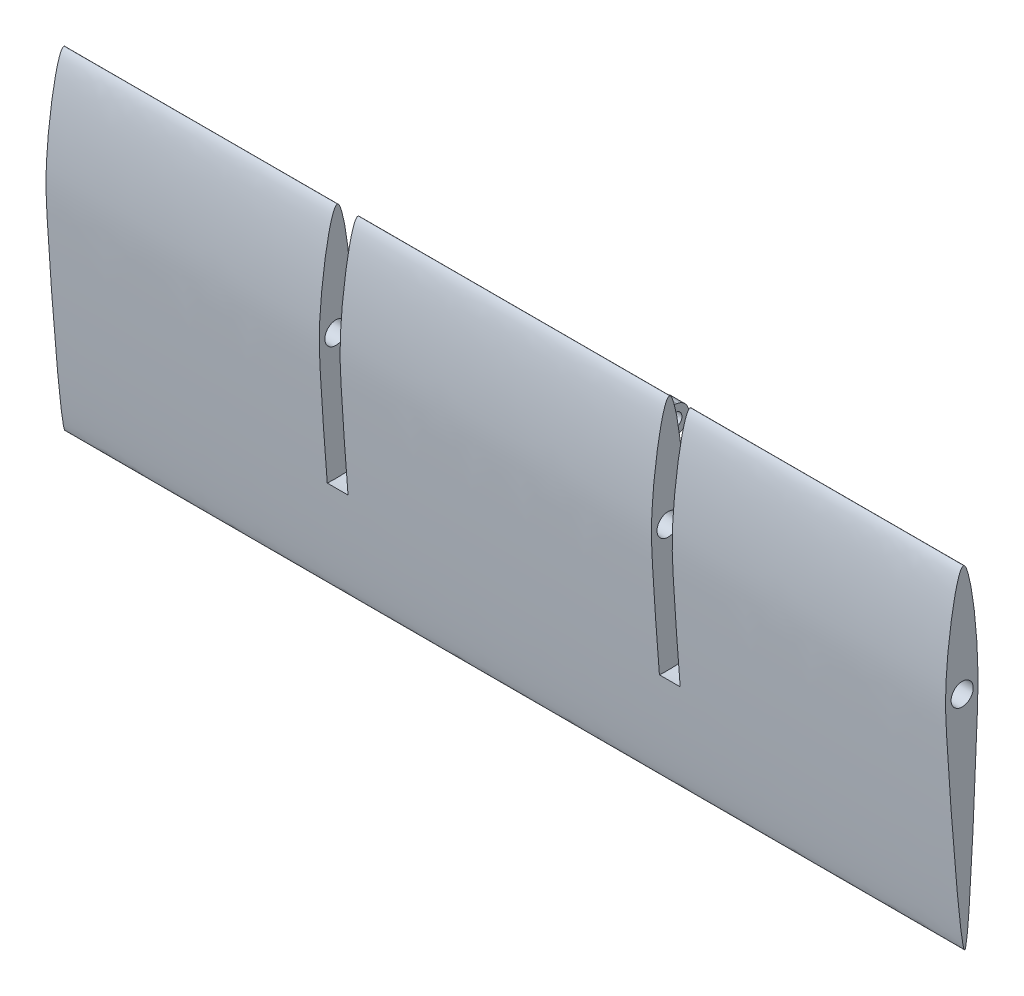
ISO-10303-21;
HEADER;
FILE_DESCRIPTION(('STEP AP214'),'2;1');
FILE_NAME('part.step','',(''),(''),'','','');
FILE_SCHEMA(('AUTOMOTIVE_DESIGN { 1 0 10303 214 1 1 1 1 }'));
ENDSEC;
DATA;
#1=APPLICATION_CONTEXT('core data for automotive mechanical design processes');
#2=APPLICATION_PROTOCOL_DEFINITION('international standard','automotive_design',2000,#1);
#3=PRODUCT_CONTEXT('',#1,'mechanical');
#4=PRODUCT('Part','Part','',(#3));
#5=PRODUCT_RELATED_PRODUCT_CATEGORY('part','',(#4));
#6=PRODUCT_DEFINITION_FORMATION('','',#4);
#7=PRODUCT_DEFINITION_CONTEXT('part definition',#1,'design');
#8=PRODUCT_DEFINITION('design','',#6,#7);
#9=PRODUCT_DEFINITION_SHAPE('','',#8);
#10=(LENGTH_UNIT() NAMED_UNIT(*) SI_UNIT(.MILLI.,.METRE.));
#11=(NAMED_UNIT(*) PLANE_ANGLE_UNIT() SI_UNIT($,.RADIAN.));
#12=(NAMED_UNIT(*) SI_UNIT($,.STERADIAN.) SOLID_ANGLE_UNIT());
#13=UNCERTAINTY_MEASURE_WITH_UNIT(LENGTH_MEASURE(1.E-05),#10,'distance_accuracy_value','');
#14=(GEOMETRIC_REPRESENTATION_CONTEXT(3) GLOBAL_UNCERTAINTY_ASSIGNED_CONTEXT((#13)) GLOBAL_UNIT_ASSIGNED_CONTEXT((#10,
#11,#12)) REPRESENTATION_CONTEXT('',''));
#15=CARTESIAN_POINT('',(0.,0.,0.));
#16=DIRECTION('',(0.,0.,1.));
#17=DIRECTION('',(1.,0.,0.));
#18=AXIS2_PLACEMENT_3D('',#15,#16,#17);
#19=CARTESIAN_POINT('',(86.75,10.9527021995449,33.7187207958643));
#20=CARTESIAN_POINT('',(86.75,11.5884045593419,34.7210901684963));
#21=CARTESIAN_POINT('',(86.75,-0.581740268397544,36.7164213565255));
#22=CARTESIAN_POINT('',(86.75,-17.2433908802926,35.8225718515825));
#23=CARTESIAN_POINT('',(86.75,-38.0378460905627,34.1110339540189));
#24=CARTESIAN_POINT('',(86.75,-36.5932545014502,33.0674302429105));
#25=CARTESIAN_POINT('',(86.75,-20.1551513082622,32.2616521389531));
#26=CARTESIAN_POINT('',(86.75,-0.490231500810746,31.4826390086823));
#27=CARTESIAN_POINT('',(86.75,9.24081671611332,32.672048511828));
#28=CARTESIAN_POINT('',(86.75,10.8832749600543,33.6092485917434));
#29=CARTESIAN_POINT('',(86.75,10.9527021995449,33.7187207958643));
#30=B_SPLINE_CURVE_WITH_KNOTS('',3,(#19,#20,#21,#22,#23,#24,#25,#26,#27,#28,#29),.UNSPECIFIED.,
.T.,.F.,(4,1,1,1,1,1,1,1,4),(0.,0.130823372940909,0.180027773058795,0.457375531387737,
0.528551930889287,0.820615368572751,0.871410968454866,0.985712329828317,0.999999999999999),.UNSPECIFIED.);
#31=DIRECTION('',(-1.,0.,0.));
#32=VECTOR('',#31,1.);
#33=SURFACE_OF_LINEAR_EXTRUSION('',#30,#32);
#34=DIRECTION('',(-1.,0.,0.));
#35=VECTOR('',#34,1.);
#36=CARTESIAN_POINT('',(86.75,-1.28855210927467,31.7758259230281));
#37=LINE('',#36,#35);
#38=CARTESIAN_POINT('',(29.75,-1.28855210927467,31.7758259230281));
#39=VERTEX_POINT('',#38);
#40=CARTESIAN_POINT('',(31.75,-1.28855211172187,31.7758259229226));
#41=VERTEX_POINT('',#40);
#42=EDGE_CURVE('E11',#39,#41,#37,.F.);
#43=ORIENTED_EDGE('',*,*,#42,.F.);
#44=CARTESIAN_POINT('',(29.75,10.9527021995449,33.7187207958643));
#45=CARTESIAN_POINT('',(29.75,11.5884045593419,34.7210901684963));
#46=CARTESIAN_POINT('',(29.75,-0.581740268397544,36.7164213565255));
#47=CARTESIAN_POINT('',(29.75,-17.2433908802926,35.8225718515825));
#48=CARTESIAN_POINT('',(29.75,-38.0378460905627,34.1110339540189));
#49=CARTESIAN_POINT('',(29.75,-36.5932545014502,33.0674302429105));
#50=CARTESIAN_POINT('',(29.75,-20.1551513082622,32.2616521389531));
#51=CARTESIAN_POINT('',(29.75,-0.490231500810746,31.4826390086823));
#52=CARTESIAN_POINT('',(29.75,9.24081671611332,32.672048511828));
#53=CARTESIAN_POINT('',(29.75,10.8832749600543,33.6092485917434));
#54=CARTESIAN_POINT('',(29.75,10.9527021995449,33.7187207958643));
#55=B_SPLINE_CURVE_WITH_KNOTS('',3,(#44,#45,#46,#47,#48,#49,#50,#51,#52,#53,#54),.UNSPECIFIED.,
.T.,.F.,(4,1,1,1,1,1,1,1,4),(0.,0.130823372940909,0.180027773058795,0.457375531387737,
0.528551930889287,0.820615368572751,0.871410968454866,0.985712329828317,0.999999999999999),.UNSPECIFIED.);
#56=CARTESIAN_POINT('',(29.75,-8.71667941807519,31.8107490621231));
#57=VERTEX_POINT('',#56);
#58=EDGE_CURVE('E56',#39,#57,#55,.F.);
#59=ORIENTED_EDGE('',*,*,#58,.T.);
#60=DIRECTION('',(-1.,0.,0.));
#61=VECTOR('',#60,1.);
#62=CARTESIAN_POINT('',(86.75,-8.71667941807519,31.8107490621231));
#63=LINE('',#62,#61);
#64=CARTESIAN_POINT('',(31.75,-8.7166794180552,31.8107490619897));
#65=VERTEX_POINT('',#64);
#66=EDGE_CURVE('E47',#65,#57,#63,.T.);
#67=ORIENTED_EDGE('',*,*,#66,.F.);
#68=CARTESIAN_POINT('',(31.75,10.9527021995449,33.7187207958643));
#69=CARTESIAN_POINT('',(31.75,11.5884045593419,34.7210901684963));
#70=CARTESIAN_POINT('',(31.75,-0.581740268397544,36.7164213565255));
#71=CARTESIAN_POINT('',(31.75,-17.2433908802926,35.8225718515825));
#72=CARTESIAN_POINT('',(31.75,-38.0378460905627,34.1110339540189));
#73=CARTESIAN_POINT('',(31.75,-36.5932545014502,33.0674302429105));
#74=CARTESIAN_POINT('',(31.75,-20.1551513082622,32.2616521389531));
#75=CARTESIAN_POINT('',(31.75,-0.490231500810746,31.4826390086823));
#76=CARTESIAN_POINT('',(31.75,9.24081671611332,32.672048511828));
#77=CARTESIAN_POINT('',(31.75,10.8832749600543,33.6092485917434));
#78=CARTESIAN_POINT('',(31.75,10.9527021995449,33.7187207958643));
#79=B_SPLINE_CURVE_WITH_KNOTS('',3,(#68,#69,#70,#71,#72,#73,#74,#75,#76,#77,#78),.UNSPECIFIED.,
.T.,.F.,(4,1,1,1,1,1,1,1,4),(0.,0.130823372940909,0.180027773058795,0.457375531387737,
0.528551930889287,0.820615368572751,0.871410968454866,0.985712329828317,0.999999999999999),.UNSPECIFIED.);
#80=EDGE_CURVE('E122',#41,#65,#79,.F.);
#81=ORIENTED_EDGE('',*,*,#80,.F.);
#82=EDGE_LOOP('',(#43,#59,#67,#81));
#83=FACE_BOUND('',#82,.T.);
#84=CARTESIAN_POINT('',(-0.750000000000001,10.9527021995449,33.7187207958643));
#85=CARTESIAN_POINT('',(-0.750000000000001,11.5884045593419,34.7210901684963));
#86=CARTESIAN_POINT('',(-0.750000000000001,-0.581740268397544,36.7164213565255));
#87=CARTESIAN_POINT('',(-0.750000000000001,-17.2433908802926,35.8225718515825));
#88=CARTESIAN_POINT('',(-0.750000000000001,-38.0378460905627,34.1110339540189));
#89=CARTESIAN_POINT('',(-0.750000000000001,-36.5932545014502,33.0674302429105));
#90=CARTESIAN_POINT('',(-0.750000000000001,-20.1551513082622,32.2616521389531));
#91=CARTESIAN_POINT('',(-0.750000000000001,-0.490231500810746,31.4826390086823));
#92=CARTESIAN_POINT('',(-0.750000000000001,9.24081671611332,32.672048511828));
#93=CARTESIAN_POINT('',(-0.750000000000001,10.8832749600543,33.6092485917434));
#94=CARTESIAN_POINT('',(-0.750000000000001,10.9527021995449,33.7187207958643));
#95=B_SPLINE_CURVE_WITH_KNOTS('',3,(#84,#85,#86,#87,#88,#89,#90,#91,#92,#93,#94),.UNSPECIFIED.,
.T.,.F.,(4,1,1,1,1,1,1,1,4),(0.,0.130823372940909,0.180027773058795,0.457375531387737,
0.528551930889287,0.820615368572751,0.871410968454866,0.985712329828317,0.999999999999999),.UNSPECIFIED.);
#96=CARTESIAN_POINT('',(-0.750000000000003,-23.2068801873793,35.2537997616904));
#97=VERTEX_POINT('',#96);
#98=CARTESIAN_POINT('',(-0.750000000000003,-23.1843809151035,32.4537817959876));
#99=VERTEX_POINT('',#98);
#100=EDGE_CURVE('E199',#97,#99,#95,.F.);
#101=ORIENTED_EDGE('',*,*,#100,.F.);
#102=DIRECTION('',(-1.,0.,0.));
#103=VECTOR('',#102,1.);
#104=CARTESIAN_POINT('',(86.75,-23.2068801873793,35.2537997616904));
#105=LINE('',#104,#103);
#106=CARTESIAN_POINT('',(-3.75,-23.2068801873793,35.2537997616904));
#107=VERTEX_POINT('',#106);
#108=EDGE_CURVE('E196',#97,#107,#105,.T.);
#109=ORIENTED_EDGE('',*,*,#108,.T.);
#110=CARTESIAN_POINT('',(-3.75,10.9527021995449,33.7187207958643));
#111=CARTESIAN_POINT('',(-3.75,11.5884045593419,34.7210901684963));
#112=CARTESIAN_POINT('',(-3.75,-0.581740268397544,36.7164213565255));
#113=CARTESIAN_POINT('',(-3.75,-17.2433908802926,35.8225718515825));
#114=CARTESIAN_POINT('',(-3.75,-38.0378460905627,34.1110339540189));
#115=CARTESIAN_POINT('',(-3.75,-36.5932545014502,33.0674302429105));
#116=CARTESIAN_POINT('',(-3.75,-20.1551513082622,32.2616521389531));
#117=CARTESIAN_POINT('',(-3.75,-0.490231500810746,31.4826390086823));
#118=CARTESIAN_POINT('',(-3.75,9.24081671611332,32.672048511828));
#119=CARTESIAN_POINT('',(-3.75,10.8832749600543,33.6092485917434));
#120=CARTESIAN_POINT('',(-3.75,10.9527021995449,33.7187207958643));
#121=B_SPLINE_CURVE_WITH_KNOTS('',3,(#110,#111,#112,#113,#114,#115,#116,#117,#118,#119,#120),
.UNSPECIFIED.,.T.,.F.,(4,1,1,1,1,1,1,1,4),(0.,0.130823372940909,0.180027773058795,
0.457375531387737,0.528551930889287,0.820615368572751,0.871410968454866,0.985712329828317,
0.999999999999999),.UNSPECIFIED.);
#122=CARTESIAN_POINT('',(-3.75,-23.1843809151035,32.4537817959876));
#123=VERTEX_POINT('',#122);
#124=EDGE_CURVE('E175',#107,#123,#121,.F.);
#125=ORIENTED_EDGE('',*,*,#124,.T.);
#126=DIRECTION('',(-1.,0.,0.));
#127=VECTOR('',#126,1.);
#128=CARTESIAN_POINT('',(86.75,-23.1843809151035,32.4537817959876));
#129=LINE('',#128,#127);
#130=EDGE_CURVE('E190',#123,#99,#129,.F.);
#131=ORIENTED_EDGE('',*,*,#130,.T.);
#132=EDGE_LOOP('',(#101,#109,#125,#131));
#133=FACE_BOUND('',#132,.T.);
#134=CARTESIAN_POINT('',(86.75,10.9527021995449,33.7187207958643));
#135=VERTEX_POINT('',#134);
#136=EDGE_CURVE('E169',#135,#135,#30,.T.);
#137=ORIENTED_EDGE('',*,*,#136,.F.);
#138=EDGE_LOOP('',(#137));
#139=FACE_BOUND('',#138,.T.);
#140=CARTESIAN_POINT('',(-43.25,10.9527021995449,33.7187207958643));
#141=CARTESIAN_POINT('',(-43.25,11.5884045593419,34.7210901684963));
#142=CARTESIAN_POINT('',(-43.25,-0.581740268397544,36.7164213565255));
#143=CARTESIAN_POINT('',(-43.25,-17.2433908802926,35.8225718515825));
#144=CARTESIAN_POINT('',(-43.25,-38.0378460905627,34.1110339540189));
#145=CARTESIAN_POINT('',(-43.25,-36.5932545014502,33.0674302429105));
#146=CARTESIAN_POINT('',(-43.25,-20.1551513082622,32.2616521389531));
#147=CARTESIAN_POINT('',(-43.25,-0.490231500810746,31.4826390086823));
#148=CARTESIAN_POINT('',(-43.25,9.24081671611332,32.672048511828));
#149=CARTESIAN_POINT('',(-43.25,10.8832749600543,33.6092485917434));
#150=CARTESIAN_POINT('',(-43.25,10.9527021995449,33.7187207958643));
#151=B_SPLINE_CURVE_WITH_KNOTS('',3,(#140,#141,#142,#143,#144,#145,#146,#147,#148,#149,#150),
.UNSPECIFIED.,.T.,.F.,(4,1,1,1,1,1,1,1,4),(0.,0.130823372940909,0.180027773058795,
0.457375531387737,0.528551930889287,0.820615368572751,0.871410968454866,0.985712329828317,
0.999999999999999),.UNSPECIFIED.);
#152=CARTESIAN_POINT('',(-43.25,10.9527021995449,33.7187207958643));
#153=VERTEX_POINT('',#152);
#154=EDGE_CURVE('E167',#153,#153,#151,.T.);
#155=ORIENTED_EDGE('',*,*,#154,.T.);
#156=EDGE_LOOP('',(#155));
#157=FACE_BOUND('',#156,.T.);
#158=CARTESIAN_POINT('',(47.25,10.9527021995449,33.7187207958643));
#159=CARTESIAN_POINT('',(47.25,11.5884045593419,34.7210901684963));
#160=CARTESIAN_POINT('',(47.25,-0.581740268397544,36.7164213565255));
#161=CARTESIAN_POINT('',(47.25,-17.2433908802926,35.8225718515825));
#162=CARTESIAN_POINT('',(47.25,-38.0378460905627,34.1110339540189));
#163=CARTESIAN_POINT('',(47.25,-36.5932545014502,33.0674302429105));
#164=CARTESIAN_POINT('',(47.25,-20.1551513082622,32.2616521389531));
#165=CARTESIAN_POINT('',(47.25,-0.490231500810746,31.4826390086823));
#166=CARTESIAN_POINT('',(47.25,9.24081671611332,32.672048511828));
#167=CARTESIAN_POINT('',(47.25,10.8832749600543,33.6092485917434));
#168=CARTESIAN_POINT('',(47.25,10.9527021995449,33.7187207958643));
#169=B_SPLINE_CURVE_WITH_KNOTS('',3,(#158,#159,#160,#161,#162,#163,#164,#165,#166,#167,#168),
.UNSPECIFIED.,.T.,.F.,(4,1,1,1,1,1,1,1,4),(0.,0.130823372940909,0.180027773058795,
0.457375531387737,0.528551930889287,0.820615368572751,0.871410968454866,0.985712329828317,
0.999999999999999),.UNSPECIFIED.);
#170=CARTESIAN_POINT('',(47.25,-23.2068801873793,35.2537997616904));
#171=VERTEX_POINT('',#170);
#172=CARTESIAN_POINT('',(47.25,-23.1843809151035,32.4537817959876));
#173=VERTEX_POINT('',#172);
#174=EDGE_CURVE('E220',#171,#173,#169,.F.);
#175=ORIENTED_EDGE('',*,*,#174,.F.);
#176=DIRECTION('',(-1.,0.,0.));
#177=VECTOR('',#176,1.);
#178=CARTESIAN_POINT('',(86.75,-23.2068801873793,35.2537997616904));
#179=LINE('',#178,#177);
#180=CARTESIAN_POINT('',(44.25,-23.2068801873793,35.2537997616904));
#181=VERTEX_POINT('',#180);
#182=EDGE_CURVE('E217',#171,#181,#179,.T.);
#183=ORIENTED_EDGE('',*,*,#182,.T.);
#184=CARTESIAN_POINT('',(44.25,10.9527021995449,33.7187207958643));
#185=CARTESIAN_POINT('',(44.25,11.5884045593419,34.7210901684963));
#186=CARTESIAN_POINT('',(44.25,-0.581740268397544,36.7164213565255));
#187=CARTESIAN_POINT('',(44.25,-17.2433908802926,35.8225718515825));
#188=CARTESIAN_POINT('',(44.25,-38.0378460905627,34.1110339540189));
#189=CARTESIAN_POINT('',(44.25,-36.5932545014502,33.0674302429105));
#190=CARTESIAN_POINT('',(44.25,-20.1551513082622,32.2616521389531));
#191=CARTESIAN_POINT('',(44.25,-0.490231500810746,31.4826390086823));
#192=CARTESIAN_POINT('',(44.25,9.24081671611332,32.672048511828));
#193=CARTESIAN_POINT('',(44.25,10.8832749600543,33.6092485917434));
#194=CARTESIAN_POINT('',(44.25,10.9527021995449,33.7187207958643));
#195=B_SPLINE_CURVE_WITH_KNOTS('',3,(#184,#185,#186,#187,#188,#189,#190,#191,#192,#193,#194),
.UNSPECIFIED.,.T.,.F.,(4,1,1,1,1,1,1,1,4),(0.,0.130823372940909,0.180027773058795,
0.457375531387737,0.528551930889287,0.820615368572751,0.871410968454866,0.985712329828317,
0.999999999999999),.UNSPECIFIED.);
#196=CARTESIAN_POINT('',(44.25,-23.1843809151035,32.4537817959876));
#197=VERTEX_POINT('',#196);
#198=EDGE_CURVE('E203',#181,#197,#195,.F.);
#199=ORIENTED_EDGE('',*,*,#198,.T.);
#200=DIRECTION('',(-1.,0.,0.));
#201=VECTOR('',#200,1.);
#202=CARTESIAN_POINT('',(86.75,-23.1843809151035,32.4537817959876));
#203=LINE('',#202,#201);
#204=EDGE_CURVE('E211',#197,#173,#203,.F.);
#205=ORIENTED_EDGE('',*,*,#204,.T.);
#206=EDGE_LOOP('',(#175,#183,#199,#205));
#207=FACE_BOUND('',#206,.T.);
#208=ADVANCED_FACE('F39',(#83,#133,#139,#157,#207),#33,.F.);
#209=CARTESIAN_POINT('',(86.75,-37.1212007736846,33.5683894511855));
#210=DIRECTION('',(-1.,0.,0.));
#211=DIRECTION('',(0.,0.,1.));
#212=AXIS2_PLACEMENT_3D('',#209,#210,#211);
#213=PLANE('',#212);
#214=CARTESIAN_POINT('',(86.75,-5.,34.));
#215=DIRECTION('',(-1.,0.,0.));
#216=DIRECTION('',(0.,0.,1.));
#217=AXIS2_PLACEMENT_3D('',#214,#215,#216);
#218=CIRCLE('',#217,1.6);
#219=CARTESIAN_POINT('',(86.75,-5.,35.6));
#220=VERTEX_POINT('',#219);
#221=EDGE_CURVE('E144',#220,#220,#218,.F.);
#222=ORIENTED_EDGE('',*,*,#221,.F.);
#223=EDGE_LOOP('',(#222));
#224=FACE_BOUND('',#223,.T.);
#225=ORIENTED_EDGE('',*,*,#136,.T.);
#226=EDGE_LOOP('',(#225));
#227=FACE_BOUND('',#226,.T.);
#228=ADVANCED_FACE('F257',(#224,#227),#213,.F.);
#229=CARTESIAN_POINT('',(-43.25,-37.1212007736846,33.5683894511855));
#230=DIRECTION('',(-1.,0.,0.));
#231=DIRECTION('',(0.,0.,1.));
#232=AXIS2_PLACEMENT_3D('',#229,#230,#231);
#233=PLANE('',#232);
#234=CARTESIAN_POINT('',(-43.25,-5.,34.));
#235=DIRECTION('',(-1.,0.,0.));
#236=DIRECTION('',(0.,0.,1.));
#237=AXIS2_PLACEMENT_3D('',#234,#235,#236);
#238=CIRCLE('',#237,1.6);
#239=CARTESIAN_POINT('',(-43.25,-5.,35.6));
#240=VERTEX_POINT('',#239);
#241=EDGE_CURVE('E138',#240,#240,#238,.T.);
#242=ORIENTED_EDGE('',*,*,#241,.F.);
#243=EDGE_LOOP('',(#242));
#244=FACE_BOUND('',#243,.T.);
#245=ORIENTED_EDGE('',*,*,#154,.F.);
#246=EDGE_LOOP('',(#245));
#247=FACE_BOUND('',#246,.T.);
#248=ADVANCED_FACE('F261',(#244,#247),#233,.T.);
#249=CARTESIAN_POINT('',(-0.750000000000003,-5.,34.));
#250=DIRECTION('',(-1.,0.,0.));
#251=DIRECTION('',(0.,0.,1.));
#252=AXIS2_PLACEMENT_3D('',#249,#250,#251);
#253=CYLINDRICAL_SURFACE('',#252,18.25);
#254=CARTESIAN_POINT('',(-0.750000000000003,-5.,34.));
#255=DIRECTION('',(-1.,0.,0.));
#256=DIRECTION('',(0.,0.,1.));
#257=AXIS2_PLACEMENT_3D('',#254,#255,#256);
#258=CIRCLE('',#257,18.25);
#259=EDGE_CURVE('E164',#99,#97,#258,.T.);
#260=ORIENTED_EDGE('',*,*,#259,.F.);
#261=ORIENTED_EDGE('',*,*,#130,.F.);
#262=CARTESIAN_POINT('',(-3.75,-5.,34.));
#263=DIRECTION('',(-1.,0.,0.));
#264=DIRECTION('',(0.,0.,1.));
#265=AXIS2_PLACEMENT_3D('',#262,#263,#264);
#266=CIRCLE('',#265,18.25);
#267=EDGE_CURVE('E161',#123,#107,#266,.T.);
#268=ORIENTED_EDGE('',*,*,#267,.T.);
#269=ORIENTED_EDGE('',*,*,#108,.F.);
#270=EDGE_LOOP('',(#260,#261,#268,#269));
#271=FACE_BOUND('',#270,.T.);
#272=ADVANCED_FACE('F301',(#271),#253,.F.);
#273=CARTESIAN_POINT('',(-0.750000000000003,-5.,34.));
#274=DIRECTION('',(-1.,0.,0.));
#275=DIRECTION('',(0.,0.,1.));
#276=AXIS2_PLACEMENT_3D('',#273,#274,#275);
#277=PLANE('',#276);
#278=CARTESIAN_POINT('',(-0.750000000000001,-5.,34.));
#279=DIRECTION('',(-1.,0.,0.));
#280=DIRECTION('',(0.,0.,1.));
#281=AXIS2_PLACEMENT_3D('',#278,#279,#280);
#282=CIRCLE('',#281,1.6);
#283=CARTESIAN_POINT('',(-0.750000000000001,-5.,35.6));
#284=VERTEX_POINT('',#283);
#285=EDGE_CURVE('E154',#284,#284,#282,.T.);
#286=ORIENTED_EDGE('',*,*,#285,.F.);
#287=EDGE_LOOP('',(#286));
#288=FACE_BOUND('',#287,.T.);
#289=ORIENTED_EDGE('',*,*,#100,.T.);
#290=ORIENTED_EDGE('',*,*,#259,.T.);
#291=EDGE_LOOP('',(#289,#290));
#292=FACE_BOUND('',#291,.T.);
#293=ADVANCED_FACE('F298',(#288,#292),#277,.T.);
#294=CARTESIAN_POINT('',(-3.75,-5.,34.));
#295=DIRECTION('',(-1.,0.,0.));
#296=DIRECTION('',(0.,0.,1.));
#297=AXIS2_PLACEMENT_3D('',#294,#295,#296);
#298=PLANE('',#297);
#299=CARTESIAN_POINT('',(-3.75,-5.,34.));
#300=DIRECTION('',(-1.,0.,0.));
#301=DIRECTION('',(0.,0.,1.));
#302=AXIS2_PLACEMENT_3D('',#299,#300,#301);
#303=CIRCLE('',#302,1.6);
#304=CARTESIAN_POINT('',(-3.75,-5.,35.6));
#305=VERTEX_POINT('',#304);
#306=EDGE_CURVE('E151',#305,#305,#303,.T.);
#307=ORIENTED_EDGE('',*,*,#306,.T.);
#308=EDGE_LOOP('',(#307));
#309=FACE_BOUND('',#308,.T.);
#310=ORIENTED_EDGE('',*,*,#267,.F.);
#311=ORIENTED_EDGE('',*,*,#124,.F.);
#312=EDGE_LOOP('',(#310,#311));
#313=FACE_BOUND('',#312,.T.);
#314=ADVANCED_FACE('F297',(#309,#313),#298,.F.);
#315=CARTESIAN_POINT('',(47.25,-5.,34.));
#316=DIRECTION('',(-1.,0.,0.));
#317=DIRECTION('',(0.,0.,1.));
#318=AXIS2_PLACEMENT_3D('',#315,#316,#317);
#319=CYLINDRICAL_SURFACE('',#318,18.25);
#320=CARTESIAN_POINT('',(47.25,-5.,34.));
#321=DIRECTION('',(-1.,0.,0.));
#322=DIRECTION('',(0.,0.,1.));
#323=AXIS2_PLACEMENT_3D('',#320,#321,#322);
#324=CIRCLE('',#323,18.25);
#325=EDGE_CURVE('E158',#173,#171,#324,.T.);
#326=ORIENTED_EDGE('',*,*,#325,.F.);
#327=ORIENTED_EDGE('',*,*,#204,.F.);
#328=CARTESIAN_POINT('',(44.25,-5.,34.));
#329=DIRECTION('',(-1.,0.,0.));
#330=DIRECTION('',(0.,0.,1.));
#331=AXIS2_PLACEMENT_3D('',#328,#329,#330);
#332=CIRCLE('',#331,18.25);
#333=EDGE_CURVE('E157',#197,#181,#332,.T.);
#334=ORIENTED_EDGE('',*,*,#333,.T.);
#335=ORIENTED_EDGE('',*,*,#182,.F.);
#336=EDGE_LOOP('',(#326,#327,#334,#335));
#337=FACE_BOUND('',#336,.T.);
#338=ADVANCED_FACE('F277',(#337),#319,.F.);
#339=CARTESIAN_POINT('',(47.25,-5.,34.));
#340=DIRECTION('',(-1.,0.,0.));
#341=DIRECTION('',(0.,0.,1.));
#342=AXIS2_PLACEMENT_3D('',#339,#340,#341);
#343=PLANE('',#342);
#344=CARTESIAN_POINT('',(47.25,-5.,34.));
#345=DIRECTION('',(-1.,0.,0.));
#346=DIRECTION('',(0.,0.,1.));
#347=AXIS2_PLACEMENT_3D('',#344,#345,#346);
#348=CIRCLE('',#347,1.6);
#349=CARTESIAN_POINT('',(47.25,-5.,35.6));
#350=VERTEX_POINT('',#349);
#351=EDGE_CURVE('E148',#350,#350,#348,.T.);
#352=ORIENTED_EDGE('',*,*,#351,.F.);
#353=EDGE_LOOP('',(#352));
#354=FACE_BOUND('',#353,.T.);
#355=ORIENTED_EDGE('',*,*,#174,.T.);
#356=ORIENTED_EDGE('',*,*,#325,.T.);
#357=EDGE_LOOP('',(#355,#356));
#358=FACE_BOUND('',#357,.T.);
#359=ADVANCED_FACE('F275',(#354,#358),#343,.T.);
#360=CARTESIAN_POINT('',(44.25,-5.,34.));
#361=DIRECTION('',(-1.,0.,0.));
#362=DIRECTION('',(0.,0.,1.));
#363=AXIS2_PLACEMENT_3D('',#360,#361,#362);
#364=PLANE('',#363);
#365=CARTESIAN_POINT('',(44.25,-5.,34.));
#366=DIRECTION('',(-1.,0.,0.));
#367=DIRECTION('',(0.,0.,1.));
#368=AXIS2_PLACEMENT_3D('',#365,#366,#367);
#369=CIRCLE('',#368,1.6);
#370=CARTESIAN_POINT('',(44.25,-5.,35.6));
#371=VERTEX_POINT('',#370);
#372=EDGE_CURVE('E147',#371,#371,#369,.T.);
#373=ORIENTED_EDGE('',*,*,#372,.T.);
#374=EDGE_LOOP('',(#373));
#375=FACE_BOUND('',#374,.T.);
#376=ORIENTED_EDGE('',*,*,#333,.F.);
#377=ORIENTED_EDGE('',*,*,#198,.F.);
#378=EDGE_LOOP('',(#376,#377));
#379=FACE_BOUND('',#378,.T.);
#380=ADVANCED_FACE('F279',(#375,#379),#364,.F.);
#381=CARTESIAN_POINT('',(91.2754833995939,-5.,34.));
#382=DIRECTION('',(-1.,0.,0.));
#383=DIRECTION('',(0.,0.,1.));
#384=AXIS2_PLACEMENT_3D('',#381,#382,#383);
#385=CYLINDRICAL_SURFACE('',#384,1.6);
#386=ORIENTED_EDGE('',*,*,#285,.T.);
#387=EDGE_LOOP('',(#386));
#388=FACE_BOUND('',#387,.T.);
#389=ORIENTED_EDGE('',*,*,#372,.F.);
#390=EDGE_LOOP('',(#389));
#391=FACE_BOUND('',#390,.T.);
#392=ADVANCED_FACE('F281',(#388,#391),#385,.F.);
#393=ORIENTED_EDGE('',*,*,#351,.T.);
#394=EDGE_LOOP('',(#393));
#395=FACE_BOUND('',#394,.T.);
#396=ORIENTED_EDGE('',*,*,#221,.T.);
#397=EDGE_LOOP('',(#396));
#398=FACE_BOUND('',#397,.T.);
#399=ADVANCED_FACE('F288',(#395,#398),#385,.F.);
#400=ORIENTED_EDGE('',*,*,#241,.T.);
#401=EDGE_LOOP('',(#400));
#402=FACE_BOUND('',#401,.T.);
#403=ORIENTED_EDGE('',*,*,#306,.F.);
#404=EDGE_LOOP('',(#403));
#405=FACE_BOUND('',#404,.T.);
#406=ADVANCED_FACE('F291',(#402,#405),#385,.F.);
#407=CARTESIAN_POINT('',(29.75,-5.91585415044972,0.886201916204042));
#408=DIRECTION('',(0.,-0.988965179468051,0.148148148148148));
#409=DIRECTION('',(0.,-0.148148148148148,-0.988965179468051));
#410=AXIS2_PLACEMENT_3D('',#407,#408,#409);
#411=PLANE('',#410);
#412=DIRECTION('',(0.,-0.148148148148148,-0.988965179468051));
#413=VECTOR('',#412,1.);
#414=CARTESIAN_POINT('',(29.75,-5.91585415044972,0.886201916204042));
#415=LINE('',#414,#413);
#416=CARTESIAN_POINT('',(29.75,-3.0220696410639,20.2037037037037));
#417=VERTEX_POINT('',#416);
#418=EDGE_CURVE('E99',#39,#417,#415,.T.);
#419=ORIENTED_EDGE('',*,*,#418,.F.);
#420=ORIENTED_EDGE('',*,*,#42,.T.);
#421=DIRECTION('',(0.,-0.148148148148148,-0.988965179468051));
#422=VECTOR('',#421,1.);
#423=CARTESIAN_POINT('',(31.75,-5.91585415044972,0.886201916204042));
#424=LINE('',#423,#422);
#425=CARTESIAN_POINT('',(31.75,-3.0220696410639,20.2037037037037));
#426=VERTEX_POINT('',#425);
#427=EDGE_CURVE('E120',#41,#426,#424,.T.);
#428=ORIENTED_EDGE('',*,*,#427,.T.);
#429=DIRECTION('',(1.,0.,0.));
#430=VECTOR('',#429,1.);
#431=CARTESIAN_POINT('',(29.75,-3.0220696410639,20.2037037037037));
#432=LINE('',#431,#430);
#433=EDGE_CURVE('E112',#417,#426,#432,.T.);
#434=ORIENTED_EDGE('',*,*,#433,.F.);
#435=EDGE_LOOP('',(#419,#420,#428,#434));
#436=FACE_BOUND('',#435,.T.);
#437=ADVANCED_FACE('F118',(#436),#411,.F.);
#438=CARTESIAN_POINT('',(29.75,-3.86466711155303,-0.578931683007884));
#439=DIRECTION('',(0.,0.988965179468051,0.148148148148148));
#440=DIRECTION('',(0.,-0.148148148148148,0.988965179468051));
#441=AXIS2_PLACEMENT_3D('',#438,#439,#440);
#442=PLANE('',#441);
#443=DIRECTION('',(0.,-0.148148148148148,0.988965179468051));
#444=VECTOR('',#443,1.);
#445=CARTESIAN_POINT('',(31.75,-3.86466711155303,-0.578931683007884));
#446=LINE('',#445,#444);
#447=CARTESIAN_POINT('',(31.75,-6.9779303589361,20.2037037037037));
#448=VERTEX_POINT('',#447);
#449=EDGE_CURVE('E232',#448,#65,#446,.T.);
#450=ORIENTED_EDGE('',*,*,#449,.T.);
#451=ORIENTED_EDGE('',*,*,#66,.T.);
#452=DIRECTION('',(0.,-0.148148148148148,0.988965179468051));
#453=VECTOR('',#452,1.);
#454=CARTESIAN_POINT('',(29.75,-3.86466711155303,-0.578931683007884));
#455=LINE('',#454,#453);
#456=CARTESIAN_POINT('',(29.75,-6.9779303589361,20.2037037037037));
#457=VERTEX_POINT('',#456);
#458=EDGE_CURVE('E116',#457,#57,#455,.T.);
#459=ORIENTED_EDGE('',*,*,#458,.F.);
#460=DIRECTION('',(1.,0.,0.));
#461=VECTOR('',#460,1.);
#462=CARTESIAN_POINT('',(29.75,-6.9779303589361,20.2037037037037));
#463=LINE('',#462,#461);
#464=EDGE_CURVE('E114',#457,#448,#463,.T.);
#465=ORIENTED_EDGE('',*,*,#464,.T.);
#466=EDGE_LOOP('',(#450,#451,#459,#465));
#467=FACE_BOUND('',#466,.T.);
#468=ADVANCED_FACE('F230',(#467),#442,.F.);
#469=CARTESIAN_POINT('',(29.75,0.,0.));
#470=DIRECTION('',(-1.,0.,0.));
#471=DIRECTION('',(0.,0.,1.));
#472=AXIS2_PLACEMENT_3D('',#469,#470,#471);
#473=PLANE('',#472);
#474=CARTESIAN_POINT('',(29.75,-5.,20.5));
#475=DIRECTION('',(-1.,0.,0.));
#476=DIRECTION('',(0.,0.,1.));
#477=AXIS2_PLACEMENT_3D('',#474,#475,#476);
#478=CIRCLE('',#477,1.);
#479=CARTESIAN_POINT('',(29.75,-5.,21.5));
#480=VERTEX_POINT('',#479);
#481=EDGE_CURVE('E126',#480,#480,#478,.T.);
#482=ORIENTED_EDGE('',*,*,#481,.F.);
#483=EDGE_LOOP('',(#482));
#484=FACE_BOUND('',#483,.T.);
#485=ORIENTED_EDGE('',*,*,#58,.F.);
#486=ORIENTED_EDGE('',*,*,#418,.T.);
#487=CARTESIAN_POINT('',(29.75,-5.,20.5));
#488=DIRECTION('',(-1.,0.,0.));
#489=DIRECTION('',(0.,0.,1.));
#490=AXIS2_PLACEMENT_3D('',#487,#488,#489);
#491=CIRCLE('',#490,2.);
#492=EDGE_CURVE('E103',#417,#457,#491,.T.);
#493=ORIENTED_EDGE('',*,*,#492,.T.);
#494=ORIENTED_EDGE('',*,*,#458,.T.);
#495=EDGE_LOOP('',(#485,#486,#493,#494));
#496=FACE_BOUND('',#495,.T.);
#497=ADVANCED_FACE('F101',(#484,#496),#473,.T.);
#498=CARTESIAN_POINT('',(31.75,0.,0.));
#499=DIRECTION('',(-1.,0.,0.));
#500=DIRECTION('',(0.,0.,1.));
#501=AXIS2_PLACEMENT_3D('',#498,#499,#500);
#502=PLANE('',#501);
#503=CARTESIAN_POINT('',(31.75,-5.,20.5));
#504=DIRECTION('',(-1.,0.,0.));
#505=DIRECTION('',(0.,0.,1.));
#506=AXIS2_PLACEMENT_3D('',#503,#504,#505);
#507=CIRCLE('',#506,1.);
#508=CARTESIAN_POINT('',(31.75,-5.,21.5));
#509=VERTEX_POINT('',#508);
#510=EDGE_CURVE('E107',#509,#509,#507,.T.);
#511=ORIENTED_EDGE('',*,*,#510,.T.);
#512=EDGE_LOOP('',(#511));
#513=FACE_BOUND('',#512,.T.);
#514=ORIENTED_EDGE('',*,*,#427,.F.);
#515=ORIENTED_EDGE('',*,*,#80,.T.);
#516=ORIENTED_EDGE('',*,*,#449,.F.);
#517=CARTESIAN_POINT('',(31.75,-5.,20.5));
#518=DIRECTION('',(-1.,0.,0.));
#519=DIRECTION('',(0.,0.,1.));
#520=AXIS2_PLACEMENT_3D('',#517,#518,#519);
#521=CIRCLE('',#520,2.);
#522=EDGE_CURVE('E238',#426,#448,#521,.T.);
#523=ORIENTED_EDGE('',*,*,#522,.F.);
#524=EDGE_LOOP('',(#514,#515,#516,#523));
#525=FACE_BOUND('',#524,.T.);
#526=ADVANCED_FACE('F243',(#513,#525),#502,.F.);
#527=CARTESIAN_POINT('',(29.75,-5.,20.5));
#528=DIRECTION('',(1.,0.,0.));
#529=DIRECTION('',(0.,0.,-1.));
#530=AXIS2_PLACEMENT_3D('',#527,#528,#529);
#531=CYLINDRICAL_SURFACE('',#530,2.);
#532=ORIENTED_EDGE('',*,*,#522,.T.);
#533=ORIENTED_EDGE('',*,*,#464,.F.);
#534=ORIENTED_EDGE('',*,*,#492,.F.);
#535=ORIENTED_EDGE('',*,*,#433,.T.);
#536=EDGE_LOOP('',(#532,#533,#534,#535));
#537=FACE_BOUND('',#536,.T.);
#538=ADVANCED_FACE('F111',(#537),#531,.T.);
#539=CARTESIAN_POINT('',(29.75,-5.,20.5));
#540=DIRECTION('',(1.,0.,0.));
#541=DIRECTION('',(0.,0.,-1.));
#542=AXIS2_PLACEMENT_3D('',#539,#540,#541);
#543=CYLINDRICAL_SURFACE('',#542,1.);
#544=ORIENTED_EDGE('',*,*,#481,.T.);
#545=EDGE_LOOP('',(#544));
#546=FACE_BOUND('',#545,.T.);
#547=ORIENTED_EDGE('',*,*,#510,.F.);
#548=EDGE_LOOP('',(#547));
#549=FACE_BOUND('',#548,.T.);
#550=ADVANCED_FACE('F246',(#546,#549),#543,.F.);
#551=CLOSED_SHELL('',(#208,#228,#248,#272,#293,#314,#338,#359,#380,#392,#399,#406,#437,#468,
#497,#526,#538,#550));
#552=MANIFOLD_SOLID_BREP('B2',#551);
#553=ADVANCED_BREP_SHAPE_REPRESENTATION('',(#18,#552),#14);
#554=SHAPE_DEFINITION_REPRESENTATION(#9,#553);
ENDSEC;
END-ISO-10303-21;
